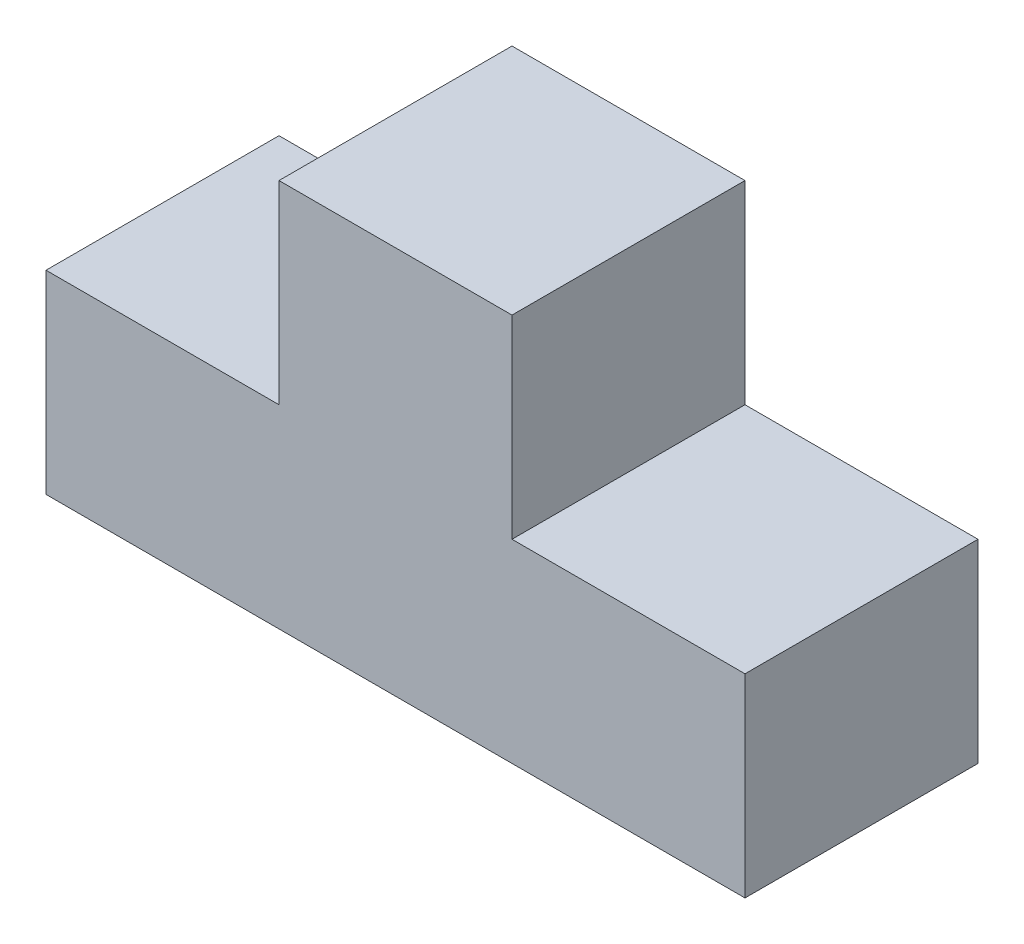
ISO-10303-21;
HEADER;
FILE_DESCRIPTION(('STEP AP214'),'2;1');
FILE_NAME('part.step','',(''),(''),'','','');
FILE_SCHEMA(('AUTOMOTIVE_DESIGN { 1 0 10303 214 1 1 1 1 }'));
ENDSEC;
DATA;
#1=APPLICATION_CONTEXT('core data for automotive mechanical design processes');
#2=APPLICATION_PROTOCOL_DEFINITION('international standard','automotive_design',2000,#1);
#3=PRODUCT_CONTEXT('',#1,'mechanical');
#4=PRODUCT('Part','Part','',(#3));
#5=PRODUCT_RELATED_PRODUCT_CATEGORY('part','',(#4));
#6=PRODUCT_DEFINITION_FORMATION('','',#4);
#7=PRODUCT_DEFINITION_CONTEXT('part definition',#1,'design');
#8=PRODUCT_DEFINITION('design','',#6,#7);
#9=PRODUCT_DEFINITION_SHAPE('','',#8);
#10=(LENGTH_UNIT() NAMED_UNIT(*) SI_UNIT(.MILLI.,.METRE.));
#11=(NAMED_UNIT(*) PLANE_ANGLE_UNIT() SI_UNIT($,.RADIAN.));
#12=(NAMED_UNIT(*) SI_UNIT($,.STERADIAN.) SOLID_ANGLE_UNIT());
#13=UNCERTAINTY_MEASURE_WITH_UNIT(LENGTH_MEASURE(1.E-05),#10,'distance_accuracy_value','');
#14=(GEOMETRIC_REPRESENTATION_CONTEXT(3) GLOBAL_UNCERTAINTY_ASSIGNED_CONTEXT((#13)) GLOBAL_UNIT_ASSIGNED_CONTEXT((#10,
#11,#12)) REPRESENTATION_CONTEXT('',''));
#15=CARTESIAN_POINT('',(0.,0.,0.));
#16=DIRECTION('',(0.,0.,1.));
#17=DIRECTION('',(1.,0.,0.));
#18=AXIS2_PLACEMENT_3D('',#15,#16,#17);
#19=CARTESIAN_POINT('',(0.,25.,30.));
#20=DIRECTION('',(1.,0.,0.));
#21=DIRECTION('',(0.,0.,-1.));
#22=AXIS2_PLACEMENT_3D('',#19,#20,#21);
#23=PLANE('',#22);
#24=DIRECTION('',(0.,-1.,0.));
#25=VECTOR('',#24,1.);
#26=CARTESIAN_POINT('',(0.,25.,0.));
#27=LINE('',#26,#25);
#28=CARTESIAN_POINT('',(0.,25.,0.));
#29=VERTEX_POINT('',#28);
#30=CARTESIAN_POINT('',(0.,0.,0.));
#31=VERTEX_POINT('',#30);
#32=EDGE_CURVE('E131',#29,#31,#27,.T.);
#33=ORIENTED_EDGE('',*,*,#32,.T.);
#34=DIRECTION('',(0.,0.,-1.));
#35=VECTOR('',#34,1.);
#36=CARTESIAN_POINT('',(0.,0.,30.));
#37=LINE('',#36,#35);
#38=CARTESIAN_POINT('',(0.,0.,30.));
#39=VERTEX_POINT('',#38);
#40=EDGE_CURVE('E11',#39,#31,#37,.T.);
#41=ORIENTED_EDGE('',*,*,#40,.F.);
#42=DIRECTION('',(0.,-1.,0.));
#43=VECTOR('',#42,1.);
#44=CARTESIAN_POINT('',(0.,25.,30.));
#45=LINE('',#44,#43);
#46=CARTESIAN_POINT('',(0.,25.,30.));
#47=VERTEX_POINT('',#46);
#48=EDGE_CURVE('E145',#47,#39,#45,.T.);
#49=ORIENTED_EDGE('',*,*,#48,.F.);
#50=DIRECTION('',(0.,0.,-1.));
#51=VECTOR('',#50,1.);
#52=CARTESIAN_POINT('',(0.,25.,30.));
#53=LINE('',#52,#51);
#54=EDGE_CURVE('E127',#47,#29,#53,.T.);
#55=ORIENTED_EDGE('',*,*,#54,.T.);
#56=EDGE_LOOP('',(#33,#41,#49,#55));
#57=FACE_BOUND('',#56,.T.);
#58=ADVANCED_FACE('F35',(#57),#23,.F.);
#59=CARTESIAN_POINT('',(0.,0.,30.));
#60=DIRECTION('',(0.,1.,0.));
#61=DIRECTION('',(0.,0.,1.));
#62=AXIS2_PLACEMENT_3D('',#59,#60,#61);
#63=PLANE('',#62);
#64=DIRECTION('',(1.,0.,0.));
#65=VECTOR('',#64,1.);
#66=CARTESIAN_POINT('',(0.,0.,0.));
#67=LINE('',#66,#65);
#68=CARTESIAN_POINT('',(90.,0.,0.));
#69=VERTEX_POINT('',#68);
#70=EDGE_CURVE('E134',#31,#69,#67,.T.);
#71=ORIENTED_EDGE('',*,*,#70,.T.);
#72=DIRECTION('',(0.,0.,-1.));
#73=VECTOR('',#72,1.);
#74=CARTESIAN_POINT('',(90.,0.,30.));
#75=LINE('',#74,#73);
#76=CARTESIAN_POINT('',(90.,0.,30.));
#77=VERTEX_POINT('',#76);
#78=EDGE_CURVE('E43',#77,#69,#75,.T.);
#79=ORIENTED_EDGE('',*,*,#78,.F.);
#80=DIRECTION('',(1.,0.,0.));
#81=VECTOR('',#80,1.);
#82=CARTESIAN_POINT('',(0.,0.,30.));
#83=LINE('',#82,#81);
#84=EDGE_CURVE('E94',#39,#77,#83,.T.);
#85=ORIENTED_EDGE('',*,*,#84,.F.);
#86=ORIENTED_EDGE('',*,*,#40,.T.);
#87=EDGE_LOOP('',(#71,#79,#85,#86));
#88=FACE_BOUND('',#87,.T.);
#89=ADVANCED_FACE('F180',(#88),#63,.F.);
#90=CARTESIAN_POINT('',(90.,0.,30.));
#91=DIRECTION('',(-1.,0.,0.));
#92=DIRECTION('',(0.,0.,1.));
#93=AXIS2_PLACEMENT_3D('',#90,#91,#92);
#94=PLANE('',#93);
#95=DIRECTION('',(0.,1.,0.));
#96=VECTOR('',#95,1.);
#97=CARTESIAN_POINT('',(90.,0.,0.));
#98=LINE('',#97,#96);
#99=CARTESIAN_POINT('',(90.,25.,0.));
#100=VERTEX_POINT('',#99);
#101=EDGE_CURVE('E136',#69,#100,#98,.T.);
#102=ORIENTED_EDGE('',*,*,#101,.T.);
#103=DIRECTION('',(0.,0.,-1.));
#104=VECTOR('',#103,1.);
#105=CARTESIAN_POINT('',(90.,25.,30.));
#106=LINE('',#105,#104);
#107=CARTESIAN_POINT('',(90.,25.,30.));
#108=VERTEX_POINT('',#107);
#109=EDGE_CURVE('E152',#108,#100,#106,.T.);
#110=ORIENTED_EDGE('',*,*,#109,.F.);
#111=DIRECTION('',(0.,1.,0.));
#112=VECTOR('',#111,1.);
#113=CARTESIAN_POINT('',(90.,0.,30.));
#114=LINE('',#113,#112);
#115=EDGE_CURVE('E160',#77,#108,#114,.T.);
#116=ORIENTED_EDGE('',*,*,#115,.F.);
#117=ORIENTED_EDGE('',*,*,#78,.T.);
#118=EDGE_LOOP('',(#102,#110,#116,#117));
#119=FACE_BOUND('',#118,.T.);
#120=ADVANCED_FACE('F158',(#119),#94,.F.);
#121=CARTESIAN_POINT('',(90.,25.,30.));
#122=DIRECTION('',(0.,-1.,0.));
#123=DIRECTION('',(1.,0.,0.));
#124=AXIS2_PLACEMENT_3D('',#121,#122,#123);
#125=PLANE('',#124);
#126=DIRECTION('',(-1.,0.,0.));
#127=VECTOR('',#126,1.);
#128=CARTESIAN_POINT('',(90.,25.,0.));
#129=LINE('',#128,#127);
#130=CARTESIAN_POINT('',(60.,25.,0.));
#131=VERTEX_POINT('',#130);
#132=EDGE_CURVE('E138',#100,#131,#129,.T.);
#133=ORIENTED_EDGE('',*,*,#132,.T.);
#134=DIRECTION('',(0.,0.,-1.));
#135=VECTOR('',#134,1.);
#136=CARTESIAN_POINT('',(60.,25.,30.));
#137=LINE('',#136,#135);
#138=CARTESIAN_POINT('',(60.,25.,30.));
#139=VERTEX_POINT('',#138);
#140=EDGE_CURVE('E149',#139,#131,#137,.T.);
#141=ORIENTED_EDGE('',*,*,#140,.F.);
#142=DIRECTION('',(-1.,0.,0.));
#143=VECTOR('',#142,1.);
#144=CARTESIAN_POINT('',(90.,25.,30.));
#145=LINE('',#144,#143);
#146=EDGE_CURVE('E172',#108,#139,#145,.T.);
#147=ORIENTED_EDGE('',*,*,#146,.F.);
#148=ORIENTED_EDGE('',*,*,#109,.T.);
#149=EDGE_LOOP('',(#133,#141,#147,#148));
#150=FACE_BOUND('',#149,.T.);
#151=ADVANCED_FACE('F168',(#150),#125,.F.);
#152=CARTESIAN_POINT('',(60.,25.,30.));
#153=DIRECTION('',(-1.,0.,0.));
#154=DIRECTION('',(0.,0.,1.));
#155=AXIS2_PLACEMENT_3D('',#152,#153,#154);
#156=PLANE('',#155);
#157=DIRECTION('',(0.,1.,0.));
#158=VECTOR('',#157,1.);
#159=CARTESIAN_POINT('',(60.,25.,0.));
#160=LINE('',#159,#158);
#161=CARTESIAN_POINT('',(60.,50.,0.));
#162=VERTEX_POINT('',#161);
#163=EDGE_CURVE('E140',#131,#162,#160,.T.);
#164=ORIENTED_EDGE('',*,*,#163,.T.);
#165=DIRECTION('',(0.,0.,-1.));
#166=VECTOR('',#165,1.);
#167=CARTESIAN_POINT('',(60.,50.,30.));
#168=LINE('',#167,#166);
#169=CARTESIAN_POINT('',(60.,50.,30.));
#170=VERTEX_POINT('',#169);
#171=EDGE_CURVE('E122',#170,#162,#168,.T.);
#172=ORIENTED_EDGE('',*,*,#171,.F.);
#173=DIRECTION('',(0.,1.,0.));
#174=VECTOR('',#173,1.);
#175=CARTESIAN_POINT('',(60.,25.,30.));
#176=LINE('',#175,#174);
#177=EDGE_CURVE('E113',#139,#170,#176,.T.);
#178=ORIENTED_EDGE('',*,*,#177,.F.);
#179=ORIENTED_EDGE('',*,*,#140,.T.);
#180=EDGE_LOOP('',(#164,#172,#178,#179));
#181=FACE_BOUND('',#180,.T.);
#182=ADVANCED_FACE('F171',(#181),#156,.F.);
#183=CARTESIAN_POINT('',(60.,50.,30.));
#184=DIRECTION('',(0.,-1.,0.));
#185=DIRECTION('',(1.,0.,0.));
#186=AXIS2_PLACEMENT_3D('',#183,#184,#185);
#187=PLANE('',#186);
#188=DIRECTION('',(-1.,0.,0.));
#189=VECTOR('',#188,1.);
#190=CARTESIAN_POINT('',(60.,50.,0.));
#191=LINE('',#190,#189);
#192=CARTESIAN_POINT('',(30.,50.,0.));
#193=VERTEX_POINT('',#192);
#194=EDGE_CURVE('E121',#162,#193,#191,.T.);
#195=ORIENTED_EDGE('',*,*,#194,.T.);
#196=DIRECTION('',(0.,0.,-1.));
#197=VECTOR('',#196,1.);
#198=CARTESIAN_POINT('',(30.,50.,30.));
#199=LINE('',#198,#197);
#200=CARTESIAN_POINT('',(30.,50.,30.));
#201=VERTEX_POINT('',#200);
#202=EDGE_CURVE('E118',#201,#193,#199,.T.);
#203=ORIENTED_EDGE('',*,*,#202,.F.);
#204=DIRECTION('',(-1.,0.,0.));
#205=VECTOR('',#204,1.);
#206=CARTESIAN_POINT('',(60.,50.,30.));
#207=LINE('',#206,#205);
#208=EDGE_CURVE('E107',#170,#201,#207,.T.);
#209=ORIENTED_EDGE('',*,*,#208,.F.);
#210=ORIENTED_EDGE('',*,*,#171,.T.);
#211=EDGE_LOOP('',(#195,#203,#209,#210));
#212=FACE_BOUND('',#211,.T.);
#213=ADVANCED_FACE('F119',(#212),#187,.F.);
#214=CARTESIAN_POINT('',(30.,50.,30.));
#215=DIRECTION('',(1.,0.,0.));
#216=DIRECTION('',(0.,1.,0.));
#217=AXIS2_PLACEMENT_3D('',#214,#215,#216);
#218=PLANE('',#217);
#219=DIRECTION('',(0.,-1.,0.));
#220=VECTOR('',#219,1.);
#221=CARTESIAN_POINT('',(30.,50.,0.));
#222=LINE('',#221,#220);
#223=CARTESIAN_POINT('',(30.,25.,0.));
#224=VERTEX_POINT('',#223);
#225=EDGE_CURVE('E80',#193,#224,#222,.T.);
#226=ORIENTED_EDGE('',*,*,#225,.T.);
#227=DIRECTION('',(0.,0.,-1.));
#228=VECTOR('',#227,1.);
#229=CARTESIAN_POINT('',(30.,25.,30.));
#230=LINE('',#229,#228);
#231=CARTESIAN_POINT('',(30.,25.,30.));
#232=VERTEX_POINT('',#231);
#233=EDGE_CURVE('E123',#232,#224,#230,.T.);
#234=ORIENTED_EDGE('',*,*,#233,.F.);
#235=DIRECTION('',(0.,-1.,0.));
#236=VECTOR('',#235,1.);
#237=CARTESIAN_POINT('',(30.,50.,30.));
#238=LINE('',#237,#236);
#239=EDGE_CURVE('E111',#201,#232,#238,.T.);
#240=ORIENTED_EDGE('',*,*,#239,.F.);
#241=ORIENTED_EDGE('',*,*,#202,.T.);
#242=EDGE_LOOP('',(#226,#234,#240,#241));
#243=FACE_BOUND('',#242,.T.);
#244=ADVANCED_FACE('F125',(#243),#218,.F.);
#245=CARTESIAN_POINT('',(30.,25.,30.));
#246=DIRECTION('',(0.,-1.,0.));
#247=DIRECTION('',(1.,0.,0.));
#248=AXIS2_PLACEMENT_3D('',#245,#246,#247);
#249=PLANE('',#248);
#250=DIRECTION('',(-1.,0.,0.));
#251=VECTOR('',#250,1.);
#252=CARTESIAN_POINT('',(30.,25.,0.));
#253=LINE('',#252,#251);
#254=EDGE_CURVE('E86',#224,#29,#253,.T.);
#255=ORIENTED_EDGE('',*,*,#254,.T.);
#256=ORIENTED_EDGE('',*,*,#54,.F.);
#257=DIRECTION('',(-1.,0.,0.));
#258=VECTOR('',#257,1.);
#259=CARTESIAN_POINT('',(30.,25.,30.));
#260=LINE('',#259,#258);
#261=EDGE_CURVE('E51',#232,#47,#260,.T.);
#262=ORIENTED_EDGE('',*,*,#261,.F.);
#263=ORIENTED_EDGE('',*,*,#233,.T.);
#264=EDGE_LOOP('',(#255,#256,#262,#263));
#265=FACE_BOUND('',#264,.T.);
#266=ADVANCED_FACE('F196',(#265),#249,.F.);
#267=CARTESIAN_POINT('',(0.,0.,30.));
#268=DIRECTION('',(0.,0.,1.));
#269=DIRECTION('',(1.,0.,0.));
#270=AXIS2_PLACEMENT_3D('',#267,#268,#269);
#271=PLANE('',#270);
#272=ORIENTED_EDGE('',*,*,#48,.T.);
#273=ORIENTED_EDGE('',*,*,#84,.T.);
#274=ORIENTED_EDGE('',*,*,#115,.T.);
#275=ORIENTED_EDGE('',*,*,#146,.T.);
#276=ORIENTED_EDGE('',*,*,#177,.T.);
#277=ORIENTED_EDGE('',*,*,#208,.T.);
#278=ORIENTED_EDGE('',*,*,#239,.T.);
#279=ORIENTED_EDGE('',*,*,#261,.T.);
#280=EDGE_LOOP('',(#272,#273,#274,#275,#276,#277,#278,#279));
#281=FACE_BOUND('',#280,.T.);
#282=ADVANCED_FACE('F109',(#281),#271,.T.);
#283=CARTESIAN_POINT('',(0.,0.,0.));
#284=DIRECTION('',(0.,0.,1.));
#285=DIRECTION('',(1.,0.,0.));
#286=AXIS2_PLACEMENT_3D('',#283,#284,#285);
#287=PLANE('',#286);
#288=ORIENTED_EDGE('',*,*,#32,.F.);
#289=ORIENTED_EDGE('',*,*,#254,.F.);
#290=ORIENTED_EDGE('',*,*,#225,.F.);
#291=ORIENTED_EDGE('',*,*,#194,.F.);
#292=ORIENTED_EDGE('',*,*,#163,.F.);
#293=ORIENTED_EDGE('',*,*,#132,.F.);
#294=ORIENTED_EDGE('',*,*,#101,.F.);
#295=ORIENTED_EDGE('',*,*,#70,.F.);
#296=EDGE_LOOP('',(#288,#289,#290,#291,#292,#293,#294,#295));
#297=FACE_BOUND('',#296,.T.);
#298=ADVANCED_FACE('F164',(#297),#287,.F.);
#299=CLOSED_SHELL('',(#58,#89,#120,#151,#182,#213,#244,#266,#282,#298));
#300=MANIFOLD_SOLID_BREP('B2',#299);
#301=ADVANCED_BREP_SHAPE_REPRESENTATION('',(#18,#300),#14);
#302=SHAPE_DEFINITION_REPRESENTATION(#9,#301);
ENDSEC;
END-ISO-10303-21;
